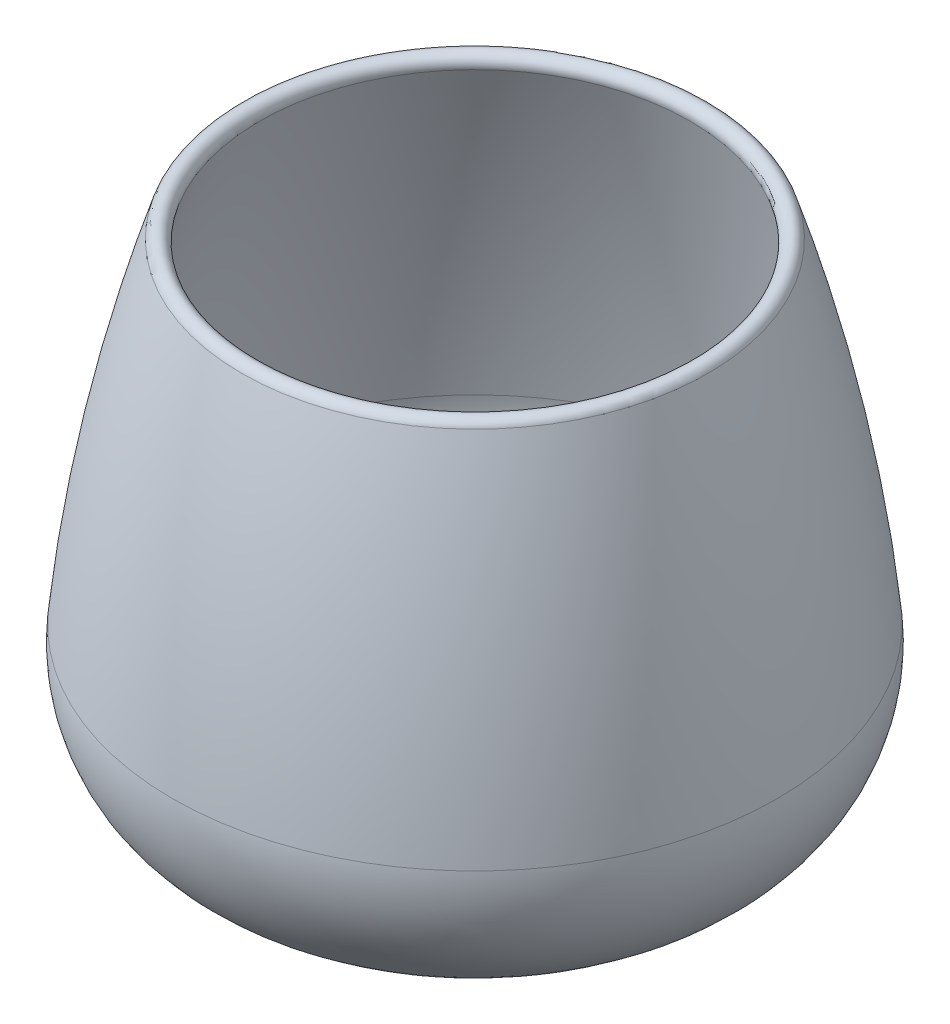
ISO-10303-21;
HEADER;
FILE_DESCRIPTION(('STEP AP214'),'2;1');
FILE_NAME('part.step','',(''),(''),'','','');
FILE_SCHEMA(('AUTOMOTIVE_DESIGN { 1 0 10303 214 1 1 1 1 }'));
ENDSEC;
DATA;
#1=APPLICATION_CONTEXT('core data for automotive mechanical design processes');
#2=APPLICATION_PROTOCOL_DEFINITION('international standard','automotive_design',2000,#1);
#3=PRODUCT_CONTEXT('',#1,'mechanical');
#4=PRODUCT('Part','Part','',(#3));
#5=PRODUCT_RELATED_PRODUCT_CATEGORY('part','',(#4));
#6=PRODUCT_DEFINITION_FORMATION('','',#4);
#7=PRODUCT_DEFINITION_CONTEXT('part definition',#1,'design');
#8=PRODUCT_DEFINITION('design','',#6,#7);
#9=PRODUCT_DEFINITION_SHAPE('','',#8);
#10=(LENGTH_UNIT() NAMED_UNIT(*) SI_UNIT(.MILLI.,.METRE.));
#11=(NAMED_UNIT(*) PLANE_ANGLE_UNIT() SI_UNIT($,.RADIAN.));
#12=(NAMED_UNIT(*) SI_UNIT($,.STERADIAN.) SOLID_ANGLE_UNIT());
#13=UNCERTAINTY_MEASURE_WITH_UNIT(LENGTH_MEASURE(1.E-05),#10,'distance_accuracy_value','');
#14=(GEOMETRIC_REPRESENTATION_CONTEXT(3) GLOBAL_UNCERTAINTY_ASSIGNED_CONTEXT((#13)) GLOBAL_UNIT_ASSIGNED_CONTEXT((#10,
#11,#12)) REPRESENTATION_CONTEXT('',''));
#15=CARTESIAN_POINT('',(0.,0.,0.));
#16=DIRECTION('',(0.,0.,1.));
#17=DIRECTION('',(1.,0.,0.));
#18=AXIS2_PLACEMENT_3D('',#15,#16,#17);
#19=CARTESIAN_POINT('',(0.,0.,0.));
#20=DIRECTION('',(0.,-1.,0.));
#21=DIRECTION('',(0.,0.,-1.));
#22=AXIS2_PLACEMENT_3D('',#19,#20,#21);
#23=PLANE('',#22);
#24=CARTESIAN_POINT('',(0.,0.,0.));
#25=DIRECTION('',(0.,-1.,0.));
#26=DIRECTION('',(0.,0.,-1.));
#27=AXIS2_PLACEMENT_3D('',#24,#25,#26);
#28=CIRCLE('',#27,12.7);
#29=CARTESIAN_POINT('',(0.,0.,-12.7));
#30=VERTEX_POINT('',#29);
#31=EDGE_CURVE('E10',#30,#30,#28,.T.);
#32=ORIENTED_EDGE('',*,*,#31,.T.);
#33=EDGE_LOOP('',(#32));
#34=FACE_BOUND('',#33,.T.);
#35=ADVANCED_FACE('F31',(#34),#23,.T.);
#36=CARTESIAN_POINT('',(0.,66.04,0.));
#37=DIRECTION('',(0.,-1.,0.));
#38=DIRECTION('',(0.,0.,-1.));
#39=AXIS2_PLACEMENT_3D('',#36,#37,#38);
#40=DEGENERATE_TOROIDAL_SURFACE('',#39,12.7,66.04,.T.);
#41=CARTESIAN_POINT('',(0.,1.08538142852788,0.));
#42=DIRECTION('',(0.,-1.,0.));
#43=DIRECTION('',(0.,0.,-1.));
#44=AXIS2_PLACEMENT_3D('',#41,#42,#43);
#45=CIRCLE('',#44,24.6238888888888);
#46=CARTESIAN_POINT('',(0.,1.08538142852788,-24.6238888888888));
#47=VERTEX_POINT('',#46);
#48=EDGE_CURVE('E37',#47,#47,#45,.T.);
#49=ORIENTED_EDGE('',*,*,#48,.T.);
#50=EDGE_LOOP('',(#49));
#51=FACE_BOUND('',#50,.T.);
#52=ORIENTED_EDGE('',*,*,#31,.F.);
#53=EDGE_LOOP('',(#52));
#54=FACE_BOUND('',#53,.T.);
#55=ADVANCED_FACE('F75',(#51,#54),#40,.T.);
#56=CARTESIAN_POINT('',(0.,21.0714179120578,0.));
#57=DIRECTION('',(0.,-1.,0.));
#58=DIRECTION('',(0.,0.,-1.));
#59=AXIS2_PLACEMENT_3D('',#56,#57,#58);
#60=TOROIDAL_SURFACE('',#59,20.955,20.32);
#61=CARTESIAN_POINT('',(0.,23.1167575103372,0.));
#62=DIRECTION('',(0.,-1.,0.));
#63=DIRECTION('',(0.,0.,-1.));
#64=AXIS2_PLACEMENT_3D('',#61,#62,#63);
#65=CIRCLE('',#64,41.1717995965659);
#66=CARTESIAN_POINT('',(0.,23.1167575103372,-41.1717995965659));
#67=VERTEX_POINT('',#66);
#68=EDGE_CURVE('E41',#67,#67,#65,.T.);
#69=ORIENTED_EDGE('',*,*,#68,.T.);
#70=EDGE_LOOP('',(#69));
#71=FACE_BOUND('',#70,.T.);
#72=ORIENTED_EDGE('',*,*,#48,.F.);
#73=EDGE_LOOP('',(#72));
#74=FACE_BOUND('',#73,.T.);
#75=ADVANCED_FACE('F79',(#71,#74),#60,.T.);
#76=CARTESIAN_POINT('',(0.,0.503915754862534,0.));
#77=DIRECTION('',(0.,-1.,0.));
#78=DIRECTION('',(0.,0.,-1.));
#79=AXIS2_PLACEMENT_3D('',#76,#77,#78);
#80=DEGENERATE_TOROIDAL_SURFACE('',#79,182.340858381526,224.653619798768,.F.);
#81=CARTESIAN_POINT('',(0.,68.58,0.));
#82=DIRECTION('',(0.,-1.,0.));
#83=DIRECTION('',(0.,0.,-1.));
#84=AXIS2_PLACEMENT_3D('',#81,#82,#83);
#85=CIRCLE('',#84,31.7499999999999);
#86=CARTESIAN_POINT('',(0.,68.58,-31.7499999999999));
#87=VERTEX_POINT('',#86);
#88=EDGE_CURVE('E45',#87,#87,#85,.T.);
#89=ORIENTED_EDGE('',*,*,#88,.T.);
#90=EDGE_LOOP('',(#89));
#91=FACE_BOUND('',#90,.T.);
#92=ORIENTED_EDGE('',*,*,#68,.F.);
#93=EDGE_LOOP('',(#92));
#94=FACE_BOUND('',#93,.T.);
#95=ADVANCED_FACE('F83',(#91,#94),#80,.F.);
#96=CARTESIAN_POINT('',(0.,68.1951558694342,0.));
#97=DIRECTION('',(0.,-1.,0.));
#98=DIRECTION('',(0.,0.,-1.));
#99=AXIS2_PLACEMENT_3D('',#96,#97,#98);
#100=TOROIDAL_SURFACE('',#99,30.5397128460087,1.27000000000004);
#101=CARTESIAN_POINT('',(0.,67.8103117388622,0.));
#102=DIRECTION('',(0.,-1.,0.));
#103=DIRECTION('',(0.,0.,-1.));
#104=AXIS2_PLACEMENT_3D('',#101,#102,#103);
#105=CIRCLE('',#104,29.3294256919976);
#106=CARTESIAN_POINT('',(0.,67.8103117388622,-29.3294256919976));
#107=VERTEX_POINT('',#106);
#108=EDGE_CURVE('E50',#107,#107,#105,.T.);
#109=ORIENTED_EDGE('',*,*,#108,.T.);
#110=EDGE_LOOP('',(#109));
#111=FACE_BOUND('',#110,.T.);
#112=ORIENTED_EDGE('',*,*,#88,.F.);
#113=EDGE_LOOP('',(#112));
#114=FACE_BOUND('',#113,.T.);
#115=ADVANCED_FACE('F90',(#111,#114),#100,.T.);
#116=CARTESIAN_POINT('',(0.,0.503915754862534,0.));
#117=DIRECTION('',(0.,-1.,0.));
#118=DIRECTION('',(0.,0.,-1.));
#119=AXIS2_PLACEMENT_3D('',#116,#117,#118);
#120=DEGENERATE_TOROIDAL_SURFACE('',#119,182.340858381526,222.113619798768,.F.);
#121=CARTESIAN_POINT('',(0.,22.8610900605523,0.));
#122=DIRECTION('',(0.,-1.,0.));
#123=DIRECTION('',(0.,0.,-1.));
#124=AXIS2_PLACEMENT_3D('',#121,#122,#123);
#125=CIRCLE('',#124,38.6446996469951);
#126=CARTESIAN_POINT('',(0.,22.8610900605523,-38.6446996469951));
#127=VERTEX_POINT('',#126);
#128=EDGE_CURVE('E53',#127,#127,#125,.T.);
#129=ORIENTED_EDGE('',*,*,#128,.T.);
#130=EDGE_LOOP('',(#129));
#131=FACE_BOUND('',#130,.T.);
#132=ORIENTED_EDGE('',*,*,#108,.F.);
#133=EDGE_LOOP('',(#132));
#134=FACE_BOUND('',#133,.T.);
#135=ADVANCED_FACE('F94',(#131,#134),#120,.T.);
#136=CARTESIAN_POINT('',(0.,21.0714179120578,0.));
#137=DIRECTION('',(0.,-1.,0.));
#138=DIRECTION('',(0.,0.,-1.));
#139=AXIS2_PLACEMENT_3D('',#136,#137,#138);
#140=TOROIDAL_SURFACE('',#139,20.955,17.78);
#141=CARTESIAN_POINT('',(0.,3.58363598896914,0.));
#142=DIRECTION('',(0.,-1.,0.));
#143=DIRECTION('',(0.,0.,-1.));
#144=AXIS2_PLACEMENT_3D('',#141,#142,#143);
#145=CIRCLE('',#144,24.1652777777778);
#146=CARTESIAN_POINT('',(0.,3.58363598896914,-24.1652777777778));
#147=VERTEX_POINT('',#146);
#148=EDGE_CURVE('E56',#147,#147,#145,.T.);
#149=ORIENTED_EDGE('',*,*,#148,.T.);
#150=EDGE_LOOP('',(#149));
#151=FACE_BOUND('',#150,.T.);
#152=ORIENTED_EDGE('',*,*,#128,.F.);
#153=EDGE_LOOP('',(#152));
#154=FACE_BOUND('',#153,.T.);
#155=ADVANCED_FACE('F72',(#151,#154),#140,.F.);
#156=CARTESIAN_POINT('',(0.,66.04,0.));
#157=DIRECTION('',(0.,-1.,0.));
#158=DIRECTION('',(0.,0.,-1.));
#159=AXIS2_PLACEMENT_3D('',#156,#157,#158);
#160=DEGENERATE_TOROIDAL_SURFACE('',#159,12.7,63.5,.T.);
#161=CARTESIAN_POINT('',(0.,2.54,0.));
#162=DIRECTION('',(0.,-1.,0.));
#163=DIRECTION('',(0.,0.,-1.));
#164=AXIS2_PLACEMENT_3D('',#161,#162,#163);
#165=CIRCLE('',#164,12.7);
#166=CARTESIAN_POINT('',(0.,2.54,-12.7));
#167=VERTEX_POINT('',#166);
#168=EDGE_CURVE('E59',#167,#167,#165,.T.);
#169=ORIENTED_EDGE('',*,*,#168,.T.);
#170=EDGE_LOOP('',(#169));
#171=FACE_BOUND('',#170,.T.);
#172=ORIENTED_EDGE('',*,*,#148,.F.);
#173=EDGE_LOOP('',(#172));
#174=FACE_BOUND('',#173,.T.);
#175=ADVANCED_FACE('F63',(#171,#174),#160,.F.);
#176=CARTESIAN_POINT('',(0.,2.54,0.));
#177=DIRECTION('',(0.,1.,0.));
#178=DIRECTION('',(0.,0.,1.));
#179=AXIS2_PLACEMENT_3D('',#176,#177,#178);
#180=PLANE('',#179);
#181=ORIENTED_EDGE('',*,*,#168,.F.);
#182=EDGE_LOOP('',(#181));
#183=FACE_BOUND('',#182,.T.);
#184=ADVANCED_FACE('F66',(#183),#180,.T.);
#185=CLOSED_SHELL('',(#35,#55,#75,#95,#115,#135,#155,#175,#184));
#186=MANIFOLD_SOLID_BREP('B2',#185);
#187=ADVANCED_BREP_SHAPE_REPRESENTATION('',(#18,#186),#14);
#188=SHAPE_DEFINITION_REPRESENTATION(#9,#187);
ENDSEC;
END-ISO-10303-21;
